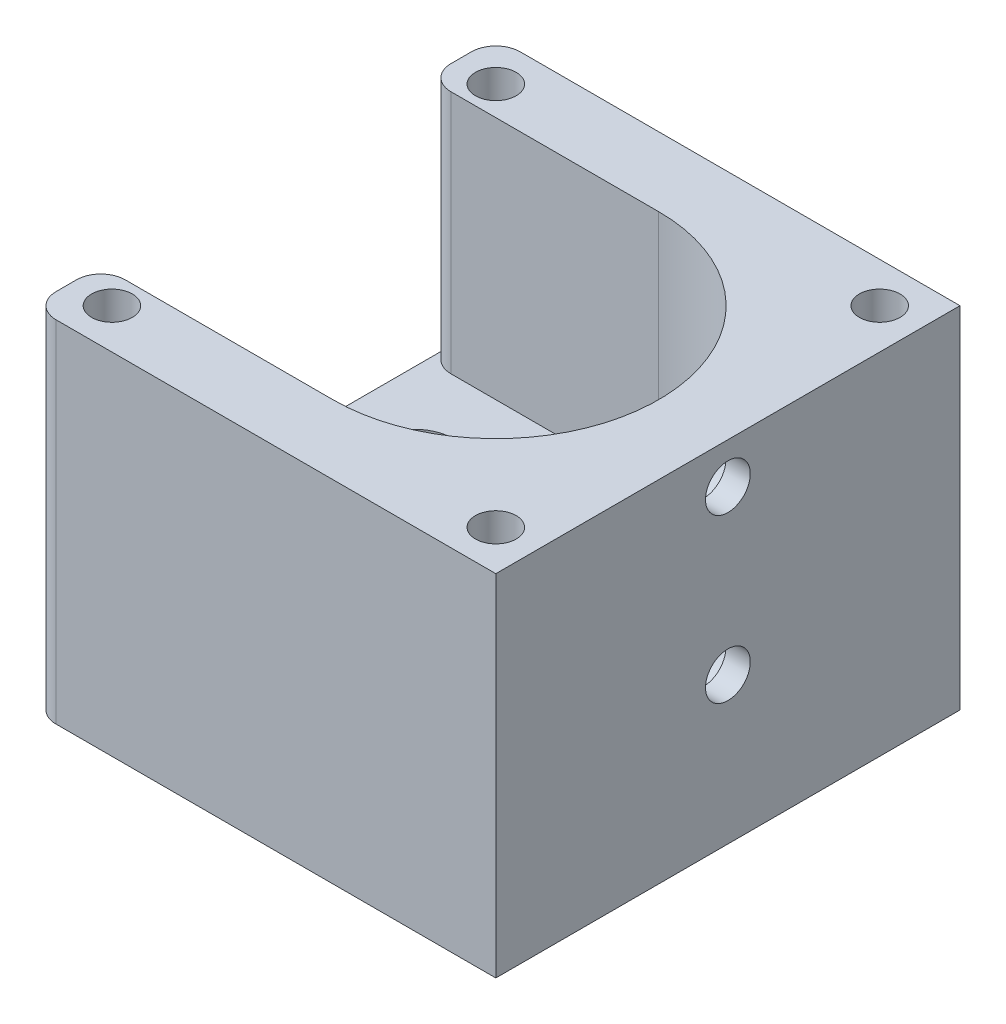
ISO-10303-21;
HEADER;
FILE_DESCRIPTION(('STEP AP214'),'2;1');
FILE_NAME('part.step','',(''),(''),'','','');
FILE_SCHEMA(('AUTOMOTIVE_DESIGN { 1 0 10303 214 1 1 1 1 }'));
ENDSEC;
DATA;
#1=APPLICATION_CONTEXT('core data for automotive mechanical design processes');
#2=APPLICATION_PROTOCOL_DEFINITION('international standard','automotive_design',2000,#1);
#3=PRODUCT_CONTEXT('',#1,'mechanical');
#4=PRODUCT('Part','Part','',(#3));
#5=PRODUCT_RELATED_PRODUCT_CATEGORY('part','',(#4));
#6=PRODUCT_DEFINITION_FORMATION('','',#4);
#7=PRODUCT_DEFINITION_CONTEXT('part definition',#1,'design');
#8=PRODUCT_DEFINITION('design','',#6,#7);
#9=PRODUCT_DEFINITION_SHAPE('','',#8);
#10=(LENGTH_UNIT() NAMED_UNIT(*) SI_UNIT(.MILLI.,.METRE.));
#11=(NAMED_UNIT(*) PLANE_ANGLE_UNIT() SI_UNIT($,.RADIAN.));
#12=(NAMED_UNIT(*) SI_UNIT($,.STERADIAN.) SOLID_ANGLE_UNIT());
#13=UNCERTAINTY_MEASURE_WITH_UNIT(LENGTH_MEASURE(1.E-05),#10,'distance_accuracy_value','');
#14=(GEOMETRIC_REPRESENTATION_CONTEXT(3) GLOBAL_UNCERTAINTY_ASSIGNED_CONTEXT((#13)) GLOBAL_UNIT_ASSIGNED_CONTEXT((#10,
#11,#12)) REPRESENTATION_CONTEXT('',''));
#15=CARTESIAN_POINT('',(0.,0.,0.));
#16=DIRECTION('',(0.,0.,1.));
#17=DIRECTION('',(1.,0.,0.));
#18=AXIS2_PLACEMENT_3D('',#15,#16,#17);
#19=CARTESIAN_POINT('',(8.49999999999999,0.,-8.5));
#20=DIRECTION('',(0.,1.,0.));
#21=DIRECTION('',(0.,0.,1.));
#22=AXIS2_PLACEMENT_3D('',#19,#20,#21);
#23=CYLINDRICAL_SURFACE('',#22,2.75);
#24=CARTESIAN_POINT('',(8.49999999999999,0.,-8.5));
#25=DIRECTION('',(0.,1.,0.));
#26=DIRECTION('',(0.,0.,1.));
#27=AXIS2_PLACEMENT_3D('',#24,#25,#26);
#28=CIRCLE('',#27,2.75);
#29=CARTESIAN_POINT('',(8.49999999999999,0.,-5.75));
#30=VERTEX_POINT('',#29);
#31=EDGE_CURVE('E404',#30,#30,#28,.T.);
#32=ORIENTED_EDGE('',*,*,#31,.F.);
#33=EDGE_LOOP('',(#32));
#34=FACE_BOUND('',#33,.T.);
#35=CARTESIAN_POINT('',(8.49999999999999,8.,-8.5));
#36=DIRECTION('',(0.,1.,0.));
#37=DIRECTION('',(0.,0.,1.));
#38=AXIS2_PLACEMENT_3D('',#35,#36,#37);
#39=CIRCLE('',#38,2.75);
#40=CARTESIAN_POINT('',(8.49999999999999,8.,-5.75));
#41=VERTEX_POINT('',#40);
#42=EDGE_CURVE('E401',#41,#41,#39,.F.);
#43=ORIENTED_EDGE('',*,*,#42,.F.);
#44=EDGE_LOOP('',(#43));
#45=FACE_BOUND('',#44,.T.);
#46=ADVANCED_FACE('F39',(#34,#45),#23,.F.);
#47=CARTESIAN_POINT('',(-18.5,0.,-8.5));
#48=DIRECTION('',(0.,1.,0.));
#49=DIRECTION('',(0.,0.,1.));
#50=AXIS2_PLACEMENT_3D('',#47,#48,#49);
#51=CYLINDRICAL_SURFACE('',#50,2.75);
#52=CARTESIAN_POINT('',(-18.5,0.,-8.5));
#53=DIRECTION('',(0.,1.,0.));
#54=DIRECTION('',(0.,0.,1.));
#55=AXIS2_PLACEMENT_3D('',#52,#53,#54);
#56=CIRCLE('',#55,2.75);
#57=CARTESIAN_POINT('',(-18.5,0.,-5.75));
#58=VERTEX_POINT('',#57);
#59=EDGE_CURVE('E429',#58,#58,#56,.T.);
#60=ORIENTED_EDGE('',*,*,#59,.F.);
#61=EDGE_LOOP('',(#60));
#62=FACE_BOUND('',#61,.T.);
#63=CARTESIAN_POINT('',(-18.5,8.,-8.5));
#64=DIRECTION('',(0.,1.,0.));
#65=DIRECTION('',(0.,0.,1.));
#66=AXIS2_PLACEMENT_3D('',#63,#64,#65);
#67=CIRCLE('',#66,2.75);
#68=CARTESIAN_POINT('',(-18.5,8.,-5.75));
#69=VERTEX_POINT('',#68);
#70=EDGE_CURVE('E405',#69,#69,#67,.F.);
#71=ORIENTED_EDGE('',*,*,#70,.F.);
#72=EDGE_LOOP('',(#71));
#73=FACE_BOUND('',#72,.T.);
#74=ADVANCED_FACE('F258',(#62,#73),#51,.F.);
#75=CARTESIAN_POINT('',(36.278174593052,38.,0.));
#76=DIRECTION('',(-1.,0.,0.));
#77=DIRECTION('',(0.,0.,1.));
#78=AXIS2_PLACEMENT_3D('',#75,#76,#77);
#79=CYLINDRICAL_SURFACE('',#78,2.75);
#80=CARTESIAN_POINT('',(28.5,38.,0.));
#81=DIRECTION('',(-1.,0.,0.));
#82=DIRECTION('',(0.,0.,1.));
#83=AXIS2_PLACEMENT_3D('',#80,#81,#82);
#84=CIRCLE('',#83,2.75);
#85=CARTESIAN_POINT('',(28.5,38.,2.75));
#86=VERTEX_POINT('',#85);
#87=EDGE_CURVE('E331',#86,#86,#84,.F.);
#88=ORIENTED_EDGE('',*,*,#87,.T.);
#89=EDGE_LOOP('',(#88));
#90=FACE_BOUND('',#89,.T.);
#91=CARTESIAN_POINT('',(25.5,38.,0.));
#92=DIRECTION('',(-1.,0.,0.));
#93=DIRECTION('',(0.,0.,1.));
#94=AXIS2_PLACEMENT_3D('',#91,#92,#93);
#95=CIRCLE('',#94,2.75);
#96=CARTESIAN_POINT('',(25.5,38.,2.75));
#97=VERTEX_POINT('',#96);
#98=EDGE_CURVE('E220',#97,#97,#95,.F.);
#99=ORIENTED_EDGE('',*,*,#98,.F.);
#100=EDGE_LOOP('',(#99));
#101=FACE_BOUND('',#100,.T.);
#102=ADVANCED_FACE('F254',(#90,#101),#79,.F.);
#103=CARTESIAN_POINT('',(36.278174593052,18.,0.));
#104=DIRECTION('',(-1.,0.,0.));
#105=DIRECTION('',(0.,0.,1.));
#106=AXIS2_PLACEMENT_3D('',#103,#104,#105);
#107=CYLINDRICAL_SURFACE('',#106,2.75);
#108=CARTESIAN_POINT('',(28.5,18.,0.));
#109=DIRECTION('',(-1.,0.,0.));
#110=DIRECTION('',(0.,0.,1.));
#111=AXIS2_PLACEMENT_3D('',#108,#109,#110);
#112=CIRCLE('',#111,2.75);
#113=CARTESIAN_POINT('',(28.5,18.,2.75));
#114=VERTEX_POINT('',#113);
#115=EDGE_CURVE('E182',#114,#114,#112,.F.);
#116=ORIENTED_EDGE('',*,*,#115,.T.);
#117=EDGE_LOOP('',(#116));
#118=FACE_BOUND('',#117,.T.);
#119=CARTESIAN_POINT('',(25.5,18.,0.));
#120=DIRECTION('',(-1.,0.,0.));
#121=DIRECTION('',(0.,0.,1.));
#122=AXIS2_PLACEMENT_3D('',#119,#120,#121);
#123=CIRCLE('',#122,2.75);
#124=CARTESIAN_POINT('',(25.5,18.,2.75));
#125=VERTEX_POINT('',#124);
#126=EDGE_CURVE('E216',#125,#125,#123,.F.);
#127=ORIENTED_EDGE('',*,*,#126,.F.);
#128=EDGE_LOOP('',(#127));
#129=FACE_BOUND('',#128,.T.);
#130=ADVANCED_FACE('F250',(#118,#129),#107,.F.);
#131=CARTESIAN_POINT('',(-28.5,13.,-28.5));
#132=DIRECTION('',(1.,0.,0.));
#133=DIRECTION('',(0.,0.,-1.));
#134=AXIS2_PLACEMENT_3D('',#131,#132,#133);
#135=PLANE('',#134);
#136=DIRECTION('',(0.,0.,1.));
#137=VECTOR('',#136,1.);
#138=CARTESIAN_POINT('',(-28.5,43.,20.));
#139=LINE('',#138,#137);
#140=CARTESIAN_POINT('',(-28.5,43.,23.));
#141=VERTEX_POINT('',#140);
#142=CARTESIAN_POINT('',(-28.5,43.,25.5));
#143=VERTEX_POINT('',#142);
#144=EDGE_CURVE('E165',#141,#143,#139,.T.);
#145=ORIENTED_EDGE('',*,*,#144,.F.);
#146=DIRECTION('',(0.,-1.,0.));
#147=VECTOR('',#146,1.);
#148=CARTESIAN_POINT('',(-28.5,13.,23.));
#149=LINE('',#148,#147);
#150=CARTESIAN_POINT('',(-28.5,13.,23.));
#151=VERTEX_POINT('',#150);
#152=EDGE_CURVE('E388',#141,#151,#149,.T.);
#153=ORIENTED_EDGE('',*,*,#152,.T.);
#154=DIRECTION('',(0.,0.,1.));
#155=VECTOR('',#154,1.);
#156=CARTESIAN_POINT('',(-28.5,13.,-28.5));
#157=LINE('',#156,#155);
#158=CARTESIAN_POINT('',(-28.5,13.,-23.));
#159=VERTEX_POINT('',#158);
#160=EDGE_CURVE('E192',#159,#151,#157,.T.);
#161=ORIENTED_EDGE('',*,*,#160,.F.);
#162=DIRECTION('',(0.,-1.,0.));
#163=VECTOR('',#162,1.);
#164=CARTESIAN_POINT('',(-28.5,13.,-23.));
#165=LINE('',#164,#163);
#166=CARTESIAN_POINT('',(-28.5,43.,-23.));
#167=VERTEX_POINT('',#166);
#168=EDGE_CURVE('E353',#159,#167,#165,.F.);
#169=ORIENTED_EDGE('',*,*,#168,.T.);
#170=DIRECTION('',(0.,0.,1.));
#171=VECTOR('',#170,1.);
#172=CARTESIAN_POINT('',(-28.5,43.,-28.5));
#173=LINE('',#172,#171);
#174=CARTESIAN_POINT('',(-28.5,43.,-25.5));
#175=VERTEX_POINT('',#174);
#176=EDGE_CURVE('E144',#175,#167,#173,.T.);
#177=ORIENTED_EDGE('',*,*,#176,.F.);
#178=DIRECTION('',(0.,-1.,0.));
#179=VECTOR('',#178,1.);
#180=CARTESIAN_POINT('',(-28.5,13.,-25.5));
#181=LINE('',#180,#179);
#182=CARTESIAN_POINT('',(-28.5,0.,-25.5));
#183=VERTEX_POINT('',#182);
#184=EDGE_CURVE('E215',#175,#183,#181,.T.);
#185=ORIENTED_EDGE('',*,*,#184,.T.);
#186=DIRECTION('',(0.,0.,1.));
#187=VECTOR('',#186,1.);
#188=CARTESIAN_POINT('',(-28.5,0.,-28.5));
#189=LINE('',#188,#187);
#190=CARTESIAN_POINT('',(-28.5,0.,25.5));
#191=VERTEX_POINT('',#190);
#192=EDGE_CURVE('E155',#183,#191,#189,.T.);
#193=ORIENTED_EDGE('',*,*,#192,.T.);
#194=DIRECTION('',(0.,-1.,0.));
#195=VECTOR('',#194,1.);
#196=CARTESIAN_POINT('',(-28.5,13.,25.5));
#197=LINE('',#196,#195);
#198=EDGE_CURVE('E396',#191,#143,#197,.F.);
#199=ORIENTED_EDGE('',*,*,#198,.T.);
#200=EDGE_LOOP('',(#145,#153,#161,#169,#177,#185,#193,#199));
#201=FACE_BOUND('',#200,.T.);
#202=ADVANCED_FACE('F253',(#201),#135,.F.);
#203=CARTESIAN_POINT('',(-28.5,13.,28.5));
#204=DIRECTION('',(0.,0.,-1.));
#205=DIRECTION('',(-1.,0.,0.));
#206=AXIS2_PLACEMENT_3D('',#203,#204,#205);
#207=PLANE('',#206);
#208=DIRECTION('',(1.,0.,0.));
#209=VECTOR('',#208,1.);
#210=CARTESIAN_POINT('',(-28.5,43.,28.5));
#211=LINE('',#210,#209);
#212=CARTESIAN_POINT('',(-25.5,43.,28.5));
#213=VERTEX_POINT('',#212);
#214=CARTESIAN_POINT('',(28.5,43.,28.5));
#215=VERTEX_POINT('',#214);
#216=EDGE_CURVE('E172',#213,#215,#211,.T.);
#217=ORIENTED_EDGE('',*,*,#216,.F.);
#218=DIRECTION('',(0.,-1.,0.));
#219=VECTOR('',#218,1.);
#220=CARTESIAN_POINT('',(-25.5,13.,28.5));
#221=LINE('',#220,#219);
#222=CARTESIAN_POINT('',(-25.5,0.,28.5));
#223=VERTEX_POINT('',#222);
#224=EDGE_CURVE('E367',#213,#223,#221,.T.);
#225=ORIENTED_EDGE('',*,*,#224,.T.);
#226=DIRECTION('',(1.,0.,0.));
#227=VECTOR('',#226,1.);
#228=CARTESIAN_POINT('',(-28.5,0.,28.5));
#229=LINE('',#228,#227);
#230=CARTESIAN_POINT('',(28.5,0.,28.5));
#231=VERTEX_POINT('',#230);
#232=EDGE_CURVE('E200',#223,#231,#229,.T.);
#233=ORIENTED_EDGE('',*,*,#232,.T.);
#234=DIRECTION('',(0.,-1.,0.));
#235=VECTOR('',#234,1.);
#236=CARTESIAN_POINT('',(28.5,13.,28.5));
#237=LINE('',#236,#235);
#238=EDGE_CURVE('E211',#215,#231,#237,.T.);
#239=ORIENTED_EDGE('',*,*,#238,.F.);
#240=EDGE_LOOP('',(#217,#225,#233,#239));
#241=FACE_BOUND('',#240,.T.);
#242=ADVANCED_FACE('F507',(#241),#207,.F.);
#243=CARTESIAN_POINT('',(28.5,13.,-28.5));
#244=DIRECTION('',(-1.,0.,0.));
#245=DIRECTION('',(0.,0.,1.));
#246=AXIS2_PLACEMENT_3D('',#243,#244,#245);
#247=PLANE('',#246);
#248=ORIENTED_EDGE('',*,*,#115,.F.);
#249=EDGE_LOOP('',(#248));
#250=FACE_BOUND('',#249,.T.);
#251=ORIENTED_EDGE('',*,*,#87,.F.);
#252=EDGE_LOOP('',(#251));
#253=FACE_BOUND('',#252,.T.);
#254=DIRECTION('',(0.,0.,-1.));
#255=VECTOR('',#254,1.);
#256=CARTESIAN_POINT('',(28.5,0.,-28.5));
#257=LINE('',#256,#255);
#258=CARTESIAN_POINT('',(28.5,0.,-28.5));
#259=VERTEX_POINT('',#258);
#260=EDGE_CURVE('E203',#231,#259,#257,.T.);
#261=ORIENTED_EDGE('',*,*,#260,.T.);
#262=DIRECTION('',(0.,-1.,0.));
#263=VECTOR('',#262,1.);
#264=CARTESIAN_POINT('',(28.5,13.,-28.5));
#265=LINE('',#264,#263);
#266=CARTESIAN_POINT('',(28.5,43.,-28.5));
#267=VERTEX_POINT('',#266);
#268=EDGE_CURVE('E195',#267,#259,#265,.T.);
#269=ORIENTED_EDGE('',*,*,#268,.F.);
#270=DIRECTION('',(0.,0.,-1.));
#271=VECTOR('',#270,1.);
#272=CARTESIAN_POINT('',(28.5,43.,28.5));
#273=LINE('',#272,#271);
#274=EDGE_CURVE('E175',#215,#267,#273,.T.);
#275=ORIENTED_EDGE('',*,*,#274,.F.);
#276=ORIENTED_EDGE('',*,*,#238,.T.);
#277=EDGE_LOOP('',(#261,#269,#275,#276));
#278=FACE_BOUND('',#277,.T.);
#279=ADVANCED_FACE('F510',(#250,#253,#278),#247,.F.);
#280=CARTESIAN_POINT('',(-28.5,13.,-28.5));
#281=DIRECTION('',(0.,0.,1.));
#282=DIRECTION('',(1.,0.,0.));
#283=AXIS2_PLACEMENT_3D('',#280,#281,#282);
#284=PLANE('',#283);
#285=DIRECTION('',(-1.,0.,0.));
#286=VECTOR('',#285,1.);
#287=CARTESIAN_POINT('',(-28.5,0.,-28.5));
#288=LINE('',#287,#286);
#289=CARTESIAN_POINT('',(-25.5,0.,-28.5));
#290=VERTEX_POINT('',#289);
#291=EDGE_CURVE('E196',#259,#290,#288,.T.);
#292=ORIENTED_EDGE('',*,*,#291,.T.);
#293=DIRECTION('',(0.,-1.,0.));
#294=VECTOR('',#293,1.);
#295=CARTESIAN_POINT('',(-25.5,13.,-28.5));
#296=LINE('',#295,#294);
#297=CARTESIAN_POINT('',(-25.5,43.,-28.5));
#298=VERTEX_POINT('',#297);
#299=EDGE_CURVE('E374',#290,#298,#296,.F.);
#300=ORIENTED_EDGE('',*,*,#299,.T.);
#301=DIRECTION('',(-1.,0.,0.));
#302=VECTOR('',#301,1.);
#303=CARTESIAN_POINT('',(28.5,43.,-28.5));
#304=LINE('',#303,#302);
#305=EDGE_CURVE('E189',#267,#298,#304,.T.);
#306=ORIENTED_EDGE('',*,*,#305,.F.);
#307=ORIENTED_EDGE('',*,*,#268,.T.);
#308=EDGE_LOOP('',(#292,#300,#306,#307));
#309=FACE_BOUND('',#308,.T.);
#310=ADVANCED_FACE('F513',(#309),#284,.F.);
#311=CARTESIAN_POINT('',(0.,13.,0.));
#312=DIRECTION('',(0.,1.,0.));
#313=DIRECTION('',(0.,0.,1.));
#314=AXIS2_PLACEMENT_3D('',#311,#312,#313);
#315=PLANE('',#314);
#316=CARTESIAN_POINT('',(-18.5,13.,-8.5));
#317=DIRECTION('',(0.,1.,0.));
#318=DIRECTION('',(0.,0.,1.));
#319=AXIS2_PLACEMENT_3D('',#316,#317,#318);
#320=CIRCLE('',#319,4.75);
#321=CARTESIAN_POINT('',(-18.5,13.,-3.75));
#322=VERTEX_POINT('',#321);
#323=EDGE_CURVE('E413',#322,#322,#320,.T.);
#324=ORIENTED_EDGE('',*,*,#323,.F.);
#325=EDGE_LOOP('',(#324));
#326=FACE_BOUND('',#325,.T.);
#327=CARTESIAN_POINT('',(8.49999999999999,13.,-8.5));
#328=DIRECTION('',(0.,1.,0.));
#329=DIRECTION('',(0.,0.,1.));
#330=AXIS2_PLACEMENT_3D('',#327,#328,#329);
#331=CIRCLE('',#330,4.75);
#332=CARTESIAN_POINT('',(8.49999999999999,13.,-3.75));
#333=VERTEX_POINT('',#332);
#334=EDGE_CURVE('E425',#333,#333,#331,.T.);
#335=ORIENTED_EDGE('',*,*,#334,.F.);
#336=EDGE_LOOP('',(#335));
#337=FACE_BOUND('',#336,.T.);
#338=DIRECTION('',(-1.,0.,0.));
#339=VECTOR('',#338,1.);
#340=CARTESIAN_POINT('',(0.,13.,20.));
#341=LINE('',#340,#339);
#342=CARTESIAN_POINT('',(0.,13.,20.));
#343=VERTEX_POINT('',#342);
#344=CARTESIAN_POINT('',(-25.5,13.,20.));
#345=VERTEX_POINT('',#344);
#346=EDGE_CURVE('E185',#343,#345,#341,.T.);
#347=ORIENTED_EDGE('',*,*,#346,.F.);
#348=CARTESIAN_POINT('',(0.,13.,0.));
#349=DIRECTION('',(0.,-1.,0.));
#350=DIRECTION('',(0.,0.,1.));
#351=AXIS2_PLACEMENT_3D('',#348,#349,#350);
#352=CIRCLE('',#351,20.);
#353=CARTESIAN_POINT('',(0.,13.,-20.));
#354=VERTEX_POINT('',#353);
#355=EDGE_CURVE('E181',#354,#343,#352,.T.);
#356=ORIENTED_EDGE('',*,*,#355,.F.);
#357=DIRECTION('',(1.,0.,0.));
#358=VECTOR('',#357,1.);
#359=CARTESIAN_POINT('',(0.,13.,-20.));
#360=LINE('',#359,#358);
#361=CARTESIAN_POINT('',(-25.5,13.,-20.));
#362=VERTEX_POINT('',#361);
#363=EDGE_CURVE('E150',#362,#354,#360,.T.);
#364=ORIENTED_EDGE('',*,*,#363,.F.);
#365=CARTESIAN_POINT('',(-25.5,13.,-23.));
#366=DIRECTION('',(0.,1.,0.));
#367=DIRECTION('',(0.,0.,1.));
#368=AXIS2_PLACEMENT_3D('',#365,#366,#367);
#369=CIRCLE('',#368,3.);
#370=EDGE_CURVE('E11',#362,#159,#369,.F.);
#371=ORIENTED_EDGE('',*,*,#370,.T.);
#372=ORIENTED_EDGE('',*,*,#160,.T.);
#373=CARTESIAN_POINT('',(-25.5,13.,23.));
#374=DIRECTION('',(0.,1.,0.));
#375=DIRECTION('',(0.,0.,1.));
#376=AXIS2_PLACEMENT_3D('',#373,#374,#375);
#377=CIRCLE('',#376,3.);
#378=EDGE_CURVE('E48',#151,#345,#377,.F.);
#379=ORIENTED_EDGE('',*,*,#378,.T.);
#380=EDGE_LOOP('',(#347,#356,#364,#371,#372,#379));
#381=FACE_BOUND('',#380,.T.);
#382=ADVANCED_FACE('F379',(#326,#337,#381),#315,.T.);
#383=CARTESIAN_POINT('',(0.,0.,0.));
#384=DIRECTION('',(0.,1.,0.));
#385=DIRECTION('',(0.,0.,1.));
#386=AXIS2_PLACEMENT_3D('',#383,#384,#385);
#387=PLANE('',#386);
#388=ORIENTED_EDGE('',*,*,#59,.T.);
#389=EDGE_LOOP('',(#388));
#390=FACE_BOUND('',#389,.T.);
#391=ORIENTED_EDGE('',*,*,#31,.T.);
#392=EDGE_LOOP('',(#391));
#393=FACE_BOUND('',#392,.T.);
#394=ORIENTED_EDGE('',*,*,#232,.F.);
#395=CARTESIAN_POINT('',(-25.5,0.,25.5));
#396=DIRECTION('',(0.,1.,0.));
#397=DIRECTION('',(0.,0.,1.));
#398=AXIS2_PLACEMENT_3D('',#395,#396,#397);
#399=CIRCLE('',#398,3.);
#400=EDGE_CURVE('E63',#223,#191,#399,.F.);
#401=ORIENTED_EDGE('',*,*,#400,.T.);
#402=ORIENTED_EDGE('',*,*,#192,.F.);
#403=CARTESIAN_POINT('',(-25.5,0.,-25.5));
#404=DIRECTION('',(0.,1.,0.));
#405=DIRECTION('',(0.,0.,1.));
#406=AXIS2_PLACEMENT_3D('',#403,#404,#405);
#407=CIRCLE('',#406,3.);
#408=EDGE_CURVE('E55',#183,#290,#407,.F.);
#409=ORIENTED_EDGE('',*,*,#408,.T.);
#410=ORIENTED_EDGE('',*,*,#291,.F.);
#411=ORIENTED_EDGE('',*,*,#260,.F.);
#412=EDGE_LOOP('',(#394,#401,#402,#409,#410,#411));
#413=FACE_BOUND('',#412,.T.);
#414=ADVANCED_FACE('F498',(#390,#393,#413),#387,.F.);
#415=CARTESIAN_POINT('',(0.,43.,-20.));
#416=DIRECTION('',(0.,0.,-1.));
#417=DIRECTION('',(-1.,0.,0.));
#418=AXIS2_PLACEMENT_3D('',#415,#416,#417);
#419=PLANE('',#418);
#420=DIRECTION('',(1.,0.,0.));
#421=VECTOR('',#420,1.);
#422=CARTESIAN_POINT('',(0.,43.,-20.));
#423=LINE('',#422,#421);
#424=CARTESIAN_POINT('',(-25.5,43.,-20.));
#425=VERTEX_POINT('',#424);
#426=CARTESIAN_POINT('',(0.,43.,-20.));
#427=VERTEX_POINT('',#426);
#428=EDGE_CURVE('E130',#425,#427,#423,.T.);
#429=ORIENTED_EDGE('',*,*,#428,.F.);
#430=DIRECTION('',(0.,-1.,0.));
#431=VECTOR('',#430,1.);
#432=CARTESIAN_POINT('',(-25.5,43.,-20.));
#433=LINE('',#432,#431);
#434=EDGE_CURVE('E354',#425,#362,#433,.T.);
#435=ORIENTED_EDGE('',*,*,#434,.T.);
#436=ORIENTED_EDGE('',*,*,#363,.T.);
#437=DIRECTION('',(0.,-1.,0.));
#438=VECTOR('',#437,1.);
#439=CARTESIAN_POINT('',(0.,43.,-20.));
#440=LINE('',#439,#438);
#441=EDGE_CURVE('E147',#427,#354,#440,.T.);
#442=ORIENTED_EDGE('',*,*,#441,.F.);
#443=EDGE_LOOP('',(#429,#435,#436,#442));
#444=FACE_BOUND('',#443,.T.);
#445=ADVANCED_FACE('F148',(#444),#419,.F.);
#446=CARTESIAN_POINT('',(0.,43.,0.));
#447=DIRECTION('',(0.,-1.,0.));
#448=DIRECTION('',(0.,0.,-1.));
#449=AXIS2_PLACEMENT_3D('',#446,#447,#448);
#450=CYLINDRICAL_SURFACE('',#449,20.);
#451=CARTESIAN_POINT('',(19.4277507704829,38.,4.75));
#452=CARTESIAN_POINT('',(19.4277559819265,37.7372598037119,4.74999183192296));
#453=CARTESIAN_POINT('',(19.4331388499466,37.474426136053,4.72812607169995));
#454=CARTESIAN_POINT('',(19.4540402105482,36.9562761002786,4.64136188794561));
#455=CARTESIAN_POINT('',(19.4695651899653,36.700964652629,4.57643592295243));
#456=CARTESIAN_POINT('',(19.5088955531062,36.2054287364653,4.4057463421885));
#457=CARTESIAN_POINT('',(19.5326909133285,35.9651864187214,4.30003214376829));
#458=CARTESIAN_POINT('',(19.5858686119401,35.5058292221803,4.05091395089128));
#459=CARTESIAN_POINT('',(19.6152510436008,35.2867146961856,3.90750932720967));
#460=CARTESIAN_POINT('',(19.6769456194717,34.8714761456058,3.58403840084774));
#461=CARTESIAN_POINT('',(19.7093007870799,34.6758337912815,3.40336187007806));
#462=CARTESIAN_POINT('',(19.7729206114238,34.3173262252618,3.01179155346311));
#463=CARTESIAN_POINT('',(19.8041851734187,34.1544638553276,2.80089515050866));
#464=CARTESIAN_POINT('',(19.8625741081372,33.8641956177069,2.35160074903825));
#465=CARTESIAN_POINT('',(19.8896417865058,33.7372588605197,2.11289167619397));
#466=CARTESIAN_POINT('',(19.9360983324634,33.5254889404029,1.61677640777372));
#467=CARTESIAN_POINT('',(19.955488219503,33.4406501873571,1.35937269983026));
#468=CARTESIAN_POINT('',(19.984100369592,33.3170158515188,0.838191316341486));
#469=CARTESIAN_POINT('',(19.9935028010491,33.2774033919827,0.57461748008035));
#470=CARTESIAN_POINT('',(20.0017069896615,33.2427861564771,0.044409020240374));
#471=CARTESIAN_POINT('',(20.0005101671058,33.2477754039266,-0.22222518846987));
#472=CARTESIAN_POINT('',(19.9877863010115,33.3016237666331,-0.745334372823519));
#473=CARTESIAN_POINT('',(19.9764667660444,33.3496016823241,-1.00190585824914));
#474=CARTESIAN_POINT('',(19.9450087545622,33.486654119388,-1.50324728469097));
#475=CARTESIAN_POINT('',(19.9248698357466,33.5757307019098,-1.74801663313535));
#476=CARTESIAN_POINT('',(19.8777116469288,33.793192154222,-2.2211787742469));
#477=CARTESIAN_POINT('',(19.8506363309143,33.9218990330356,-2.44941775919545));
#478=CARTESIAN_POINT('',(19.7925557676866,34.21472511825,-2.88137207620285));
#479=CARTESIAN_POINT('',(19.7615498975453,34.3788499407137,-3.08508351104907));
#480=CARTESIAN_POINT('',(19.6981044798807,34.7426081437258,-3.46745045058158));
#481=CARTESIAN_POINT('',(19.6656484162678,34.9430122333591,-3.64537074407425));
#482=CARTESIAN_POINT('',(19.6036618123393,35.3711522256291,-3.96523200476322));
#483=CARTESIAN_POINT('',(19.5741313828765,35.5988891631892,-4.10717160896274));
#484=CARTESIAN_POINT('',(19.5212863176313,36.0765663139191,-4.3514521373662));
#485=CARTESIAN_POINT('',(19.4979970811874,36.3265918975182,-4.45363199380446));
#486=CARTESIAN_POINT('',(19.4606064789487,36.8409548555512,-4.6142899630517));
#487=CARTESIAN_POINT('',(19.4465033620939,37.1052894919795,-4.6727764050207));
#488=CARTESIAN_POINT('',(19.4294451715587,37.6339902547521,-4.74320075037925));
#489=CARTESIAN_POINT('',(19.4262314557574,37.8982043236204,-4.75621884077739));
#490=CARTESIAN_POINT('',(19.4306145221283,38.4250283336886,-4.73828065372101));
#491=CARTESIAN_POINT('',(19.4382104158353,38.687638404943,-4.70732799031779));
#492=CARTESIAN_POINT('',(19.4631104551983,39.1998935994888,-4.60327009705961));
#493=CARTESIAN_POINT('',(19.4802729336774,39.4496711225534,-4.53077955411227));
#494=CARTESIAN_POINT('',(19.5222406435723,39.9335322817217,-4.34637847813474));
#495=CARTESIAN_POINT('',(19.5470467105976,40.1676141985479,-4.23446363498439));
#496=CARTESIAN_POINT('',(19.6020609329742,40.6180568612952,-3.97208094677737));
#497=CARTESIAN_POINT('',(19.6323578004174,40.8340256110131,-3.82095914613844));
#498=CARTESIAN_POINT('',(19.6947156781241,41.2379352249214,-3.4852910283692));
#499=CARTESIAN_POINT('',(19.7267769483006,41.4258719445197,-3.30073977754215));
#500=CARTESIAN_POINT('',(19.7899177986732,41.7726821309629,-2.89852250799558));
#501=CARTESIAN_POINT('',(19.8209594619894,41.9308127639878,-2.68020896566572));
#502=CARTESIAN_POINT('',(19.8778176716627,42.2081617343035,-2.21949450675254));
#503=CARTESIAN_POINT('',(19.9036344815225,42.3273820341268,-1.97709480581489));
#504=CARTESIAN_POINT('',(19.9469767933049,42.5225455796524,-1.47671251134755));
#505=CARTESIAN_POINT('',(19.9645593226519,42.598787251978,-1.21885148210001));
#506=CARTESIAN_POINT('',(19.9897004732305,42.7067420620659,-0.693509413535963));
#507=CARTESIAN_POINT('',(19.9972608288717,42.7384629045352,-0.426030046973755));
#508=CARTESIAN_POINT('',(20.0014429591352,42.7560779216343,0.10394803210251));
#509=CARTESIAN_POINT('',(19.9983276261779,42.7430734434836,0.366408649577264));
#510=CARTESIAN_POINT('',(19.9820832077258,42.6741050323582,0.885290017957531));
#511=CARTESIAN_POINT('',(19.968954368602,42.6181421563263,1.14171091730347));
#512=CARTESIAN_POINT('',(19.9341901702435,42.465411365764,1.64020507715498));
#513=CARTESIAN_POINT('',(19.9125926849913,42.3688249922574,1.88233677084454));
#514=CARTESIAN_POINT('',(19.8631781021279,42.1377572640152,2.3470908880729));
#515=CARTESIAN_POINT('',(19.8353602908625,42.0032715606516,2.56971106898526));
#516=CARTESIAN_POINT('',(19.7757567352568,41.6967674187902,2.99440898808425));
#517=CARTESIAN_POINT('',(19.7438973150332,41.5239901344637,3.19592875444405));
#518=CARTESIAN_POINT('',(19.6801584815131,41.1473047483318,3.5674893601326));
#519=CARTESIAN_POINT('',(19.6482790652191,40.9433889471716,3.7375223909345));
#520=CARTESIAN_POINT('',(19.5875197425717,40.5061907026866,4.04400063056234));
#521=CARTESIAN_POINT('',(19.5586975829844,40.2724816008695,4.17984945567669));
#522=CARTESIAN_POINT('',(19.5080701545674,39.7848995471072,4.4101248381262));
#523=CARTESIAN_POINT('',(19.4862594314562,39.5310424611554,4.50458361415316));
#524=CARTESIAN_POINT('',(19.455795854468,39.0644337589989,4.63415781028952));
#525=CARTESIAN_POINT('',(19.4453540980731,38.8540475986991,4.67750881773091));
#526=CARTESIAN_POINT('',(19.4313296623041,38.4291282206522,4.73543226449892));
#527=CARTESIAN_POINT('',(19.4277465139921,38.214595287442,4.75000667134631));
#528=CARTESIAN_POINT('',(19.4277507704829,38.,4.75));
#529=B_SPLINE_CURVE_WITH_KNOTS('',3,(#451,#452,#453,#454,#455,#456,#457,#458,#459,#460,#461,
#462,#463,#464,#465,#466,#467,#468,#469,#470,#471,#472,#473,#474,#475,#476,#477,#478,#479,#480,
#481,#482,#483,#484,#485,#486,#487,#488,#489,#490,#491,#492,#493,#494,#495,#496,#497,#498,#499,
#500,#501,#502,#503,#504,#505,#506,#507,#508,#509,#510,#511,#512,#513,#514,#515,#516,#517,#518,
#519,#520,#521,#522,#523,#524,#525,#526,#527,#528),.UNSPECIFIED.,.T.,.F.,(4,2,2,2,2,2,2,2,2,2,2,
2,2,2,2,2,2,2,2,2,2,2,2,2,2,2,2,2,2,2,2,2,2,2,2,2,2,2,4),(0.,0.787433214399116,1.57537056025236,
2.36235625607637,3.14935509110976,3.95043951564345,4.7515933578737,5.56277088467069,
6.37384066785989,7.17001689723764,7.96608644145081,8.74620196214962,9.52635661085807,
10.3130254573667,11.0998191341664,11.9058682145071,12.7119478245066,13.5212597079955,
14.3304172751067,15.1202159103393,15.9099496340706,16.688287862353,17.4667112100401,
18.2590619248984,19.0515296745248,19.8616962058661,20.6718218682716,21.4762507716885,
22.2805404446923,23.0651679965395,23.8497762441354,24.6309148241014,25.4121430696396,
26.2105142819856,27.0090832213603,27.8207448446472,28.6317735299573,29.2749602751437,
29.9181030426861),.UNSPECIFIED.);
#530=CARTESIAN_POINT('',(19.4277507704829,38.,4.75));
#531=VERTEX_POINT('',#530);
#532=EDGE_CURVE('E234',#531,#531,#529,.T.);
#533=ORIENTED_EDGE('',*,*,#532,.T.);
#534=EDGE_LOOP('',(#533));
#535=FACE_BOUND('',#534,.T.);
#536=CARTESIAN_POINT('',(19.4277507704829,18.,4.75));
#537=CARTESIAN_POINT('',(19.4277559819265,17.7372598037119,4.74999183192296));
#538=CARTESIAN_POINT('',(19.4331388499466,17.474426136053,4.72812607169995));
#539=CARTESIAN_POINT('',(19.4540402105482,16.9562761002786,4.64136188794561));
#540=CARTESIAN_POINT('',(19.4695651899653,16.700964652629,4.57643592295243));
#541=CARTESIAN_POINT('',(19.5088955531062,16.2054287364653,4.4057463421885));
#542=CARTESIAN_POINT('',(19.5326909133285,15.9651864187214,4.30003214376829));
#543=CARTESIAN_POINT('',(19.5858686119401,15.5058292221803,4.05091395089128));
#544=CARTESIAN_POINT('',(19.6152510436008,15.2867146961856,3.90750932720967));
#545=CARTESIAN_POINT('',(19.6769456194717,14.8714761456058,3.58403840084774));
#546=CARTESIAN_POINT('',(19.7093007870799,14.6758337912815,3.40336187007806));
#547=CARTESIAN_POINT('',(19.7729206114238,14.3173262252618,3.01179155346311));
#548=CARTESIAN_POINT('',(19.8041851734186,14.1544638553276,2.80089515050865));
#549=CARTESIAN_POINT('',(19.8625741081372,13.8641956177069,2.35160074903824));
#550=CARTESIAN_POINT('',(19.8896417865058,13.7372588605197,2.11289167619397));
#551=CARTESIAN_POINT('',(19.9360983324634,13.5254889404029,1.61677640777372));
#552=CARTESIAN_POINT('',(19.955488219503,13.4406501873571,1.35937269983026));
#553=CARTESIAN_POINT('',(19.984100369592,13.3170158515188,0.838191316341485));
#554=CARTESIAN_POINT('',(19.9935028010491,13.2774033919827,0.574617480080348));
#555=CARTESIAN_POINT('',(20.0017069896615,13.2427861564771,0.0444090202403727));
#556=CARTESIAN_POINT('',(20.0005101671058,13.2477754039266,-0.222225188469871));
#557=CARTESIAN_POINT('',(19.9877863010115,13.3016237666331,-0.745334372823521));
#558=CARTESIAN_POINT('',(19.9764667660444,13.3496016823241,-1.00190585824915));
#559=CARTESIAN_POINT('',(19.9450087545622,13.486654119388,-1.50324728469097));
#560=CARTESIAN_POINT('',(19.9248698357466,13.5757307019098,-1.74801663313535));
#561=CARTESIAN_POINT('',(19.8777116469288,13.793192154222,-2.2211787742469));
#562=CARTESIAN_POINT('',(19.8506363309143,13.9218990330356,-2.44941775919545));
#563=CARTESIAN_POINT('',(19.7925557676866,14.21472511825,-2.88137207620285));
#564=CARTESIAN_POINT('',(19.7615498975453,14.3788499407137,-3.08508351104907));
#565=CARTESIAN_POINT('',(19.6981044798807,14.7426081437258,-3.46745045058158));
#566=CARTESIAN_POINT('',(19.6656484162678,14.9430122333591,-3.64537074407426));
#567=CARTESIAN_POINT('',(19.6036618123393,15.3711522256291,-3.96523200476322));
#568=CARTESIAN_POINT('',(19.5741313828765,15.5988891631892,-4.10717160896274));
#569=CARTESIAN_POINT('',(19.5212863176313,16.0765663139192,-4.3514521373662));
#570=CARTESIAN_POINT('',(19.4979970811874,16.3265918975182,-4.45363199380447));
#571=CARTESIAN_POINT('',(19.4606064789487,16.8409548555512,-4.61428996305171));
#572=CARTESIAN_POINT('',(19.4465033620939,17.1052894919795,-4.67277640502071));
#573=CARTESIAN_POINT('',(19.4294451715587,17.6339902547521,-4.74320075037925));
#574=CARTESIAN_POINT('',(19.4262314557574,17.8982043236204,-4.75621884077739));
#575=CARTESIAN_POINT('',(19.4306145221283,18.4250283336886,-4.73828065372101));
#576=CARTESIAN_POINT('',(19.4382104158353,18.687638404943,-4.70732799031779));
#577=CARTESIAN_POINT('',(19.4631104551983,19.1998935994888,-4.60327009705961));
#578=CARTESIAN_POINT('',(19.4802729336774,19.4496711225534,-4.53077955411227));
#579=CARTESIAN_POINT('',(19.5222406435723,19.9335322817217,-4.34637847813474));
#580=CARTESIAN_POINT('',(19.5470467105976,20.1676141985479,-4.23446363498439));
#581=CARTESIAN_POINT('',(19.6020609329742,20.6180568612952,-3.97208094677737));
#582=CARTESIAN_POINT('',(19.6323578004174,20.8340256110131,-3.82095914613844));
#583=CARTESIAN_POINT('',(19.6947156781241,21.2379352249214,-3.4852910283692));
#584=CARTESIAN_POINT('',(19.7267769483006,21.4258719445197,-3.30073977754215));
#585=CARTESIAN_POINT('',(19.7899177986732,21.7726821309629,-2.89852250799558));
#586=CARTESIAN_POINT('',(19.8209594619894,21.9308127639878,-2.68020896566573));
#587=CARTESIAN_POINT('',(19.8778176716627,22.2081617343035,-2.21949450675254));
#588=CARTESIAN_POINT('',(19.9036344815225,22.3273820341268,-1.97709480581489));
#589=CARTESIAN_POINT('',(19.946976793305,22.5225455796524,-1.47671251134755));
#590=CARTESIAN_POINT('',(19.9645593226519,22.598787251978,-1.21885148210001));
#591=CARTESIAN_POINT('',(19.9897004732305,22.7067420620659,-0.693509413535959));
#592=CARTESIAN_POINT('',(19.9972608288717,22.7384629045351,-0.426030046973752));
#593=CARTESIAN_POINT('',(20.0014429591352,22.7560779216343,0.103948032102514));
#594=CARTESIAN_POINT('',(19.9983276261779,22.7430734434836,0.366408649577268));
#595=CARTESIAN_POINT('',(19.9820832077258,22.6741050323582,0.885290017957534));
#596=CARTESIAN_POINT('',(19.968954368602,22.6181421563263,1.14171091730347));
#597=CARTESIAN_POINT('',(19.9341901702435,22.465411365764,1.64020507715498));
#598=CARTESIAN_POINT('',(19.9125926849913,22.3688249922574,1.88233677084454));
#599=CARTESIAN_POINT('',(19.8631781021279,22.1377572640152,2.3470908880729));
#600=CARTESIAN_POINT('',(19.8353602908625,22.0032715606516,2.56971106898526));
#601=CARTESIAN_POINT('',(19.7757567352568,21.6967674187902,2.99440898808425));
#602=CARTESIAN_POINT('',(19.7438973150332,21.5239901344637,3.19592875444405));
#603=CARTESIAN_POINT('',(19.6801584815131,21.1473047483318,3.5674893601326));
#604=CARTESIAN_POINT('',(19.6482790652191,20.9433889471716,3.7375223909345));
#605=CARTESIAN_POINT('',(19.5875197425717,20.5061907026866,4.04400063056234));
#606=CARTESIAN_POINT('',(19.5586975829844,20.2724816008695,4.17984945567669));
#607=CARTESIAN_POINT('',(19.5080701545674,19.7848995471072,4.4101248381262));
#608=CARTESIAN_POINT('',(19.4862594314562,19.5310424611554,4.50458361415316));
#609=CARTESIAN_POINT('',(19.455795854468,19.0644337589989,4.63415781028952));
#610=CARTESIAN_POINT('',(19.4453540980731,18.8540475986991,4.67750881773091));
#611=CARTESIAN_POINT('',(19.4313296623041,18.4291282206522,4.73543226449892));
#612=CARTESIAN_POINT('',(19.4277465139921,18.214595287442,4.75000667134631));
#613=CARTESIAN_POINT('',(19.4277507704829,18.,4.75));
#614=B_SPLINE_CURVE_WITH_KNOTS('',3,(#536,#537,#538,#539,#540,#541,#542,#543,#544,#545,#546,
#547,#548,#549,#550,#551,#552,#553,#554,#555,#556,#557,#558,#559,#560,#561,#562,#563,#564,#565,
#566,#567,#568,#569,#570,#571,#572,#573,#574,#575,#576,#577,#578,#579,#580,#581,#582,#583,#584,
#585,#586,#587,#588,#589,#590,#591,#592,#593,#594,#595,#596,#597,#598,#599,#600,#601,#602,#603,
#604,#605,#606,#607,#608,#609,#610,#611,#612,#613),.UNSPECIFIED.,.T.,.F.,(4,2,2,2,2,2,2,2,2,2,2,
2,2,2,2,2,2,2,2,2,2,2,2,2,2,2,2,2,2,2,2,2,2,2,2,2,2,2,4),(0.,0.787433214399119,1.57537056025236,
2.36235625607637,3.14935509110977,3.95043951564346,4.75159335787371,5.56277088467069,
6.37384066785989,7.17001689723764,7.96608644145081,8.74620196214963,9.52635661085808,
10.3130254573667,11.0998191341664,11.9058682145072,12.7119478245066,13.5212597079955,
14.3304172751067,15.1202159103393,15.9099496340706,16.688287862353,17.4667112100401,
18.2590619248984,19.0515296745248,19.8616962058661,20.6718218682716,21.4762507716885,
22.2805404446923,23.0651679965395,23.8497762441354,24.6309148241014,25.4121430696396,
26.2105142819856,27.0090832213604,27.8207448446472,28.6317735299573,29.2749602751437,
29.9181030426861),.UNSPECIFIED.);
#615=CARTESIAN_POINT('',(19.4277507704829,18.,4.75));
#616=VERTEX_POINT('',#615);
#617=EDGE_CURVE('E225',#616,#616,#614,.T.);
#618=ORIENTED_EDGE('',*,*,#617,.T.);
#619=EDGE_LOOP('',(#618));
#620=FACE_BOUND('',#619,.T.);
#621=ORIENTED_EDGE('',*,*,#355,.T.);
#622=DIRECTION('',(0.,-1.,0.));
#623=VECTOR('',#622,1.);
#624=CARTESIAN_POINT('',(0.,43.,20.));
#625=LINE('',#624,#623);
#626=CARTESIAN_POINT('',(0.,43.,20.));
#627=VERTEX_POINT('',#626);
#628=EDGE_CURVE('E156',#627,#343,#625,.T.);
#629=ORIENTED_EDGE('',*,*,#628,.F.);
#630=CARTESIAN_POINT('',(0.,43.,0.));
#631=DIRECTION('',(0.,-1.,0.));
#632=DIRECTION('',(0.,0.,1.));
#633=AXIS2_PLACEMENT_3D('',#630,#631,#632);
#634=CIRCLE('',#633,20.);
#635=EDGE_CURVE('E135',#427,#627,#634,.T.);
#636=ORIENTED_EDGE('',*,*,#635,.F.);
#637=ORIENTED_EDGE('',*,*,#441,.T.);
#638=EDGE_LOOP('',(#621,#629,#636,#637));
#639=FACE_BOUND('',#638,.T.);
#640=ADVANCED_FACE('F158',(#535,#620,#639),#450,.F.);
#641=CARTESIAN_POINT('',(0.,43.,20.));
#642=DIRECTION('',(0.,0.,1.));
#643=DIRECTION('',(1.,0.,0.));
#644=AXIS2_PLACEMENT_3D('',#641,#642,#643);
#645=PLANE('',#644);
#646=ORIENTED_EDGE('',*,*,#346,.T.);
#647=DIRECTION('',(0.,-1.,0.));
#648=VECTOR('',#647,1.);
#649=CARTESIAN_POINT('',(-25.5,43.,20.));
#650=LINE('',#649,#648);
#651=CARTESIAN_POINT('',(-25.5,43.,20.));
#652=VERTEX_POINT('',#651);
#653=EDGE_CURVE('E384',#345,#652,#650,.F.);
#654=ORIENTED_EDGE('',*,*,#653,.T.);
#655=DIRECTION('',(-1.,0.,0.));
#656=VECTOR('',#655,1.);
#657=CARTESIAN_POINT('',(0.,43.,20.));
#658=LINE('',#657,#656);
#659=EDGE_CURVE('E162',#627,#652,#658,.T.);
#660=ORIENTED_EDGE('',*,*,#659,.F.);
#661=ORIENTED_EDGE('',*,*,#628,.T.);
#662=EDGE_LOOP('',(#646,#654,#660,#661));
#663=FACE_BOUND('',#662,.T.);
#664=ADVANCED_FACE('F261',(#663),#645,.F.);
#665=CARTESIAN_POINT('',(0.,43.,0.));
#666=DIRECTION('',(0.,1.,0.));
#667=DIRECTION('',(0.,0.,1.));
#668=AXIS2_PLACEMENT_3D('',#665,#666,#667);
#669=PLANE('',#668);
#670=CARTESIAN_POINT('',(-23.57,43.,23.57));
#671=DIRECTION('',(0.,1.,0.));
#672=DIRECTION('',(0.,0.,1.));
#673=AXIS2_PLACEMENT_3D('',#670,#671,#672);
#674=CIRCLE('',#673,2.5);
#675=CARTESIAN_POINT('',(-23.57,43.,26.07));
#676=VERTEX_POINT('',#675);
#677=EDGE_CURVE('E433',#676,#676,#674,.T.);
#678=ORIENTED_EDGE('',*,*,#677,.F.);
#679=EDGE_LOOP('',(#678));
#680=FACE_BOUND('',#679,.T.);
#681=CARTESIAN_POINT('',(23.57,43.,23.57));
#682=DIRECTION('',(0.,1.,0.));
#683=DIRECTION('',(0.,0.,1.));
#684=AXIS2_PLACEMENT_3D('',#681,#682,#683);
#685=CIRCLE('',#684,2.5);
#686=CARTESIAN_POINT('',(23.57,43.,26.07));
#687=VERTEX_POINT('',#686);
#688=EDGE_CURVE('E450',#687,#687,#685,.T.);
#689=ORIENTED_EDGE('',*,*,#688,.F.);
#690=EDGE_LOOP('',(#689));
#691=FACE_BOUND('',#690,.T.);
#692=CARTESIAN_POINT('',(23.57,43.,-23.57));
#693=DIRECTION('',(0.,1.,0.));
#694=DIRECTION('',(0.,0.,1.));
#695=AXIS2_PLACEMENT_3D('',#692,#693,#694);
#696=CIRCLE('',#695,2.5);
#697=CARTESIAN_POINT('',(23.57,43.,-21.07));
#698=VERTEX_POINT('',#697);
#699=EDGE_CURVE('E442',#698,#698,#696,.T.);
#700=ORIENTED_EDGE('',*,*,#699,.F.);
#701=EDGE_LOOP('',(#700));
#702=FACE_BOUND('',#701,.T.);
#703=CARTESIAN_POINT('',(-23.57,43.,-23.57));
#704=DIRECTION('',(0.,1.,0.));
#705=DIRECTION('',(0.,0.,1.));
#706=AXIS2_PLACEMENT_3D('',#703,#704,#705);
#707=CIRCLE('',#706,2.5);
#708=CARTESIAN_POINT('',(-23.57,43.,-21.07));
#709=VERTEX_POINT('',#708);
#710=EDGE_CURVE('E441',#709,#709,#707,.T.);
#711=ORIENTED_EDGE('',*,*,#710,.F.);
#712=EDGE_LOOP('',(#711));
#713=FACE_BOUND('',#712,.T.);
#714=ORIENTED_EDGE('',*,*,#659,.T.);
#715=CARTESIAN_POINT('',(-25.5,43.,23.));
#716=DIRECTION('',(0.,1.,0.));
#717=DIRECTION('',(0.,0.,1.));
#718=AXIS2_PLACEMENT_3D('',#715,#716,#717);
#719=CIRCLE('',#718,3.);
#720=EDGE_CURVE('E356',#652,#141,#719,.T.);
#721=ORIENTED_EDGE('',*,*,#720,.T.);
#722=ORIENTED_EDGE('',*,*,#144,.T.);
#723=CARTESIAN_POINT('',(-25.5,43.,25.5));
#724=DIRECTION('',(0.,1.,0.));
#725=DIRECTION('',(0.,0.,1.));
#726=AXIS2_PLACEMENT_3D('',#723,#724,#725);
#727=CIRCLE('',#726,3.);
#728=EDGE_CURVE('E357',#143,#213,#727,.T.);
#729=ORIENTED_EDGE('',*,*,#728,.T.);
#730=ORIENTED_EDGE('',*,*,#216,.T.);
#731=ORIENTED_EDGE('',*,*,#274,.T.);
#732=ORIENTED_EDGE('',*,*,#305,.T.);
#733=CARTESIAN_POINT('',(-25.5,43.,-25.5));
#734=DIRECTION('',(0.,1.,0.));
#735=DIRECTION('',(0.,0.,1.));
#736=AXIS2_PLACEMENT_3D('',#733,#734,#735);
#737=CIRCLE('',#736,3.);
#738=EDGE_CURVE('E346',#298,#175,#737,.T.);
#739=ORIENTED_EDGE('',*,*,#738,.T.);
#740=ORIENTED_EDGE('',*,*,#176,.T.);
#741=CARTESIAN_POINT('',(-25.5,43.,-23.));
#742=DIRECTION('',(0.,1.,0.));
#743=DIRECTION('',(0.,0.,1.));
#744=AXIS2_PLACEMENT_3D('',#741,#742,#743);
#745=CIRCLE('',#744,3.);
#746=EDGE_CURVE('E139',#167,#425,#745,.T.);
#747=ORIENTED_EDGE('',*,*,#746,.T.);
#748=ORIENTED_EDGE('',*,*,#428,.T.);
#749=ORIENTED_EDGE('',*,*,#635,.T.);
#750=EDGE_LOOP('',(#714,#721,#722,#729,#730,#731,#732,#739,#740,#747,#748,#749));
#751=FACE_BOUND('',#750,.T.);
#752=ADVANCED_FACE('F133',(#680,#691,#702,#713,#751),#669,.T.);
#753=CARTESIAN_POINT('',(25.5,18.,0.));
#754=DIRECTION('',(-1.,0.,0.));
#755=DIRECTION('',(0.,0.,1.));
#756=AXIS2_PLACEMENT_3D('',#753,#754,#755);
#757=CYLINDRICAL_SURFACE('',#756,4.75);
#758=CARTESIAN_POINT('',(25.5,18.,0.));
#759=DIRECTION('',(-1.,0.,0.));
#760=DIRECTION('',(0.,0.,1.));
#761=AXIS2_PLACEMENT_3D('',#758,#759,#760);
#762=CIRCLE('',#761,4.75);
#763=CARTESIAN_POINT('',(25.5,18.,4.75));
#764=VERTEX_POINT('',#763);
#765=EDGE_CURVE('E465',#764,#764,#762,.T.);
#766=ORIENTED_EDGE('',*,*,#765,.F.);
#767=EDGE_LOOP('',(#766));
#768=FACE_BOUND('',#767,.T.);
#769=ORIENTED_EDGE('',*,*,#617,.F.);
#770=EDGE_LOOP('',(#769));
#771=FACE_BOUND('',#770,.T.);
#772=ADVANCED_FACE('F243',(#768,#771),#757,.F.);
#773=CARTESIAN_POINT('',(25.5,18.,0.));
#774=DIRECTION('',(-1.,0.,0.));
#775=DIRECTION('',(0.,0.,1.));
#776=AXIS2_PLACEMENT_3D('',#773,#774,#775);
#777=PLANE('',#776);
#778=ORIENTED_EDGE('',*,*,#765,.T.);
#779=EDGE_LOOP('',(#778));
#780=FACE_BOUND('',#779,.T.);
#781=ORIENTED_EDGE('',*,*,#126,.T.);
#782=EDGE_LOOP('',(#781));
#783=FACE_BOUND('',#782,.T.);
#784=ADVANCED_FACE('F248',(#780,#783),#777,.T.);
#785=CARTESIAN_POINT('',(25.5,38.,0.));
#786=DIRECTION('',(-1.,0.,0.));
#787=DIRECTION('',(0.,0.,1.));
#788=AXIS2_PLACEMENT_3D('',#785,#786,#787);
#789=CYLINDRICAL_SURFACE('',#788,4.75);
#790=CARTESIAN_POINT('',(25.5,38.,0.));
#791=DIRECTION('',(-1.,0.,0.));
#792=DIRECTION('',(0.,0.,1.));
#793=AXIS2_PLACEMENT_3D('',#790,#791,#792);
#794=CIRCLE('',#793,4.75);
#795=CARTESIAN_POINT('',(25.5,38.,4.75));
#796=VERTEX_POINT('',#795);
#797=EDGE_CURVE('E221',#796,#796,#794,.T.);
#798=ORIENTED_EDGE('',*,*,#797,.F.);
#799=EDGE_LOOP('',(#798));
#800=FACE_BOUND('',#799,.T.);
#801=ORIENTED_EDGE('',*,*,#532,.F.);
#802=EDGE_LOOP('',(#801));
#803=FACE_BOUND('',#802,.T.);
#804=ADVANCED_FACE('F316',(#800,#803),#789,.F.);
#805=CARTESIAN_POINT('',(25.5,38.,0.));
#806=DIRECTION('',(-1.,0.,0.));
#807=DIRECTION('',(0.,0.,1.));
#808=AXIS2_PLACEMENT_3D('',#805,#806,#807);
#809=PLANE('',#808);
#810=ORIENTED_EDGE('',*,*,#797,.T.);
#811=EDGE_LOOP('',(#810));
#812=FACE_BOUND('',#811,.T.);
#813=ORIENTED_EDGE('',*,*,#98,.T.);
#814=EDGE_LOOP('',(#813));
#815=FACE_BOUND('',#814,.T.);
#816=ADVANCED_FACE('F313',(#812,#815),#809,.T.);
#817=CARTESIAN_POINT('',(-23.57,38.,-23.57));
#818=DIRECTION('',(0.,1.,0.));
#819=DIRECTION('',(0.,0.,1.));
#820=AXIS2_PLACEMENT_3D('',#817,#818,#819);
#821=CYLINDRICAL_SURFACE('',#820,2.5);
#822=CARTESIAN_POINT('',(-23.57,38.,-23.57));
#823=DIRECTION('',(0.,1.,0.));
#824=DIRECTION('',(0.,0.,1.));
#825=AXIS2_PLACEMENT_3D('',#822,#823,#824);
#826=CIRCLE('',#825,2.5);
#827=CARTESIAN_POINT('',(-23.57,38.,-21.07));
#828=VERTEX_POINT('',#827);
#829=EDGE_CURVE('E461',#828,#828,#826,.T.);
#830=ORIENTED_EDGE('',*,*,#829,.F.);
#831=EDGE_LOOP('',(#830));
#832=FACE_BOUND('',#831,.T.);
#833=ORIENTED_EDGE('',*,*,#710,.T.);
#834=EDGE_LOOP('',(#833));
#835=FACE_BOUND('',#834,.T.);
#836=ADVANCED_FACE('F309',(#832,#835),#821,.F.);
#837=CARTESIAN_POINT('',(-23.57,38.,-23.57));
#838=DIRECTION('',(0.,1.,0.));
#839=DIRECTION('',(0.,0.,1.));
#840=AXIS2_PLACEMENT_3D('',#837,#838,#839);
#841=PLANE('',#840);
#842=ORIENTED_EDGE('',*,*,#829,.T.);
#843=EDGE_LOOP('',(#842));
#844=FACE_BOUND('',#843,.T.);
#845=ADVANCED_FACE('F289',(#844),#841,.T.);
#846=CARTESIAN_POINT('',(23.57,38.,-23.57));
#847=DIRECTION('',(0.,1.,0.));
#848=DIRECTION('',(0.,0.,1.));
#849=AXIS2_PLACEMENT_3D('',#846,#847,#848);
#850=CYLINDRICAL_SURFACE('',#849,2.5);
#851=CARTESIAN_POINT('',(23.57,38.,-23.57));
#852=DIRECTION('',(0.,1.,0.));
#853=DIRECTION('',(0.,0.,1.));
#854=AXIS2_PLACEMENT_3D('',#851,#852,#853);
#855=CIRCLE('',#854,2.5);
#856=CARTESIAN_POINT('',(23.57,38.,-21.07));
#857=VERTEX_POINT('',#856);
#858=EDGE_CURVE('E437',#857,#857,#855,.T.);
#859=ORIENTED_EDGE('',*,*,#858,.F.);
#860=EDGE_LOOP('',(#859));
#861=FACE_BOUND('',#860,.T.);
#862=ORIENTED_EDGE('',*,*,#699,.T.);
#863=EDGE_LOOP('',(#862));
#864=FACE_BOUND('',#863,.T.);
#865=ADVANCED_FACE('F285',(#861,#864),#850,.F.);
#866=CARTESIAN_POINT('',(23.57,38.,-23.57));
#867=DIRECTION('',(0.,1.,0.));
#868=DIRECTION('',(0.,0.,1.));
#869=AXIS2_PLACEMENT_3D('',#866,#867,#868);
#870=PLANE('',#869);
#871=ORIENTED_EDGE('',*,*,#858,.T.);
#872=EDGE_LOOP('',(#871));
#873=FACE_BOUND('',#872,.T.);
#874=ADVANCED_FACE('F281',(#873),#870,.T.);
#875=CARTESIAN_POINT('',(23.57,38.,23.57));
#876=DIRECTION('',(0.,1.,0.));
#877=DIRECTION('',(0.,0.,1.));
#878=AXIS2_PLACEMENT_3D('',#875,#876,#877);
#879=CYLINDRICAL_SURFACE('',#878,2.5);
#880=CARTESIAN_POINT('',(23.57,38.,23.57));
#881=DIRECTION('',(0.,1.,0.));
#882=DIRECTION('',(0.,0.,1.));
#883=AXIS2_PLACEMENT_3D('',#880,#881,#882);
#884=CIRCLE('',#883,2.5);
#885=CARTESIAN_POINT('',(23.57,38.,26.07));
#886=VERTEX_POINT('',#885);
#887=EDGE_CURVE('E446',#886,#886,#884,.T.);
#888=ORIENTED_EDGE('',*,*,#887,.F.);
#889=EDGE_LOOP('',(#888));
#890=FACE_BOUND('',#889,.T.);
#891=ORIENTED_EDGE('',*,*,#688,.T.);
#892=EDGE_LOOP('',(#891));
#893=FACE_BOUND('',#892,.T.);
#894=ADVANCED_FACE('F284',(#890,#893),#879,.F.);
#895=CARTESIAN_POINT('',(23.57,38.,23.57));
#896=DIRECTION('',(0.,1.,0.));
#897=DIRECTION('',(0.,0.,1.));
#898=AXIS2_PLACEMENT_3D('',#895,#896,#897);
#899=PLANE('',#898);
#900=ORIENTED_EDGE('',*,*,#887,.T.);
#901=EDGE_LOOP('',(#900));
#902=FACE_BOUND('',#901,.T.);
#903=ADVANCED_FACE('F291',(#902),#899,.T.);
#904=CARTESIAN_POINT('',(-23.57,38.,23.57));
#905=DIRECTION('',(0.,1.,0.));
#906=DIRECTION('',(0.,0.,1.));
#907=AXIS2_PLACEMENT_3D('',#904,#905,#906);
#908=CYLINDRICAL_SURFACE('',#907,2.5);
#909=CARTESIAN_POINT('',(-23.57,38.,23.57));
#910=DIRECTION('',(0.,1.,0.));
#911=DIRECTION('',(0.,0.,1.));
#912=AXIS2_PLACEMENT_3D('',#909,#910,#911);
#913=CIRCLE('',#912,2.5);
#914=CARTESIAN_POINT('',(-23.57,38.,26.07));
#915=VERTEX_POINT('',#914);
#916=EDGE_CURVE('E454',#915,#915,#913,.T.);
#917=ORIENTED_EDGE('',*,*,#916,.F.);
#918=EDGE_LOOP('',(#917));
#919=FACE_BOUND('',#918,.T.);
#920=ORIENTED_EDGE('',*,*,#677,.T.);
#921=EDGE_LOOP('',(#920));
#922=FACE_BOUND('',#921,.T.);
#923=ADVANCED_FACE('F294',(#919,#922),#908,.F.);
#924=CARTESIAN_POINT('',(-23.57,38.,23.57));
#925=DIRECTION('',(0.,1.,0.));
#926=DIRECTION('',(0.,0.,1.));
#927=AXIS2_PLACEMENT_3D('',#924,#925,#926);
#928=PLANE('',#927);
#929=ORIENTED_EDGE('',*,*,#916,.T.);
#930=EDGE_LOOP('',(#929));
#931=FACE_BOUND('',#930,.T.);
#932=ADVANCED_FACE('F299',(#931),#928,.T.);
#933=CARTESIAN_POINT('',(-18.5,8.,-8.5));
#934=DIRECTION('',(0.,1.,0.));
#935=DIRECTION('',(0.,0.,1.));
#936=AXIS2_PLACEMENT_3D('',#933,#934,#935);
#937=PLANE('',#936);
#938=CARTESIAN_POINT('',(-18.5,8.,-8.5));
#939=DIRECTION('',(0.,1.,0.));
#940=DIRECTION('',(0.,0.,1.));
#941=AXIS2_PLACEMENT_3D('',#938,#939,#940);
#942=CIRCLE('',#941,4.75);
#943=CARTESIAN_POINT('',(-18.5,8.,-3.75));
#944=VERTEX_POINT('',#943);
#945=EDGE_CURVE('E408',#944,#944,#942,.T.);
#946=ORIENTED_EDGE('',*,*,#945,.T.);
#947=EDGE_LOOP('',(#946));
#948=FACE_BOUND('',#947,.T.);
#949=ORIENTED_EDGE('',*,*,#70,.T.);
#950=EDGE_LOOP('',(#949));
#951=FACE_BOUND('',#950,.T.);
#952=ADVANCED_FACE('F302',(#948,#951),#937,.T.);
#953=CARTESIAN_POINT('',(-18.5,8.,-8.5));
#954=DIRECTION('',(0.,1.,0.));
#955=DIRECTION('',(0.,0.,1.));
#956=AXIS2_PLACEMENT_3D('',#953,#954,#955);
#957=CYLINDRICAL_SURFACE('',#956,4.75);
#958=ORIENTED_EDGE('',*,*,#945,.F.);
#959=EDGE_LOOP('',(#958));
#960=FACE_BOUND('',#959,.T.);
#961=ORIENTED_EDGE('',*,*,#323,.T.);
#962=EDGE_LOOP('',(#961));
#963=FACE_BOUND('',#962,.T.);
#964=ADVANCED_FACE('F644',(#960,#963),#957,.F.);
#965=CARTESIAN_POINT('',(8.49999999999999,8.,-8.5));
#966=DIRECTION('',(0.,1.,0.));
#967=DIRECTION('',(0.,0.,1.));
#968=AXIS2_PLACEMENT_3D('',#965,#966,#967);
#969=PLANE('',#968);
#970=CARTESIAN_POINT('',(8.49999999999999,8.,-8.5));
#971=DIRECTION('',(0.,1.,0.));
#972=DIRECTION('',(0.,0.,1.));
#973=AXIS2_PLACEMENT_3D('',#970,#971,#972);
#974=CIRCLE('',#973,4.75);
#975=CARTESIAN_POINT('',(8.49999999999999,8.,-3.75));
#976=VERTEX_POINT('',#975);
#977=EDGE_CURVE('E419',#976,#976,#974,.T.);
#978=ORIENTED_EDGE('',*,*,#977,.T.);
#979=EDGE_LOOP('',(#978));
#980=FACE_BOUND('',#979,.T.);
#981=ORIENTED_EDGE('',*,*,#42,.T.);
#982=EDGE_LOOP('',(#981));
#983=FACE_BOUND('',#982,.T.);
#984=ADVANCED_FACE('F653',(#980,#983),#969,.T.);
#985=CARTESIAN_POINT('',(8.49999999999999,8.,-8.5));
#986=DIRECTION('',(0.,1.,0.));
#987=DIRECTION('',(0.,0.,1.));
#988=AXIS2_PLACEMENT_3D('',#985,#986,#987);
#989=CYLINDRICAL_SURFACE('',#988,4.75);
#990=ORIENTED_EDGE('',*,*,#977,.F.);
#991=EDGE_LOOP('',(#990));
#992=FACE_BOUND('',#991,.T.);
#993=ORIENTED_EDGE('',*,*,#334,.T.);
#994=EDGE_LOOP('',(#993));
#995=FACE_BOUND('',#994,.T.);
#996=ADVANCED_FACE('F528',(#992,#995),#989,.F.);
#997=CARTESIAN_POINT('',(-25.5,13.,23.));
#998=DIRECTION('',(0.,-1.,0.));
#999=DIRECTION('',(0.,0.,-1.));
#1000=AXIS2_PLACEMENT_3D('',#997,#998,#999);
#1001=CYLINDRICAL_SURFACE('',#1000,3.);
#1002=ORIENTED_EDGE('',*,*,#720,.F.);
#1003=ORIENTED_EDGE('',*,*,#653,.F.);
#1004=ORIENTED_EDGE('',*,*,#378,.F.);
#1005=ORIENTED_EDGE('',*,*,#152,.F.);
#1006=EDGE_LOOP('',(#1002,#1003,#1004,#1005));
#1007=FACE_BOUND('',#1006,.T.);
#1008=ADVANCED_FACE('F386',(#1007),#1001,.T.);
#1009=CARTESIAN_POINT('',(-25.5,43.,-23.));
#1010=DIRECTION('',(0.,-1.,0.));
#1011=DIRECTION('',(0.,0.,-1.));
#1012=AXIS2_PLACEMENT_3D('',#1009,#1010,#1011);
#1013=CYLINDRICAL_SURFACE('',#1012,3.);
#1014=ORIENTED_EDGE('',*,*,#746,.F.);
#1015=ORIENTED_EDGE('',*,*,#168,.F.);
#1016=ORIENTED_EDGE('',*,*,#370,.F.);
#1017=ORIENTED_EDGE('',*,*,#434,.F.);
#1018=EDGE_LOOP('',(#1014,#1015,#1016,#1017));
#1019=FACE_BOUND('',#1018,.T.);
#1020=ADVANCED_FACE('F352',(#1019),#1013,.T.);
#1021=CARTESIAN_POINT('',(-25.5,13.,25.5));
#1022=DIRECTION('',(0.,-1.,0.));
#1023=DIRECTION('',(0.,0.,-1.));
#1024=AXIS2_PLACEMENT_3D('',#1021,#1022,#1023);
#1025=CYLINDRICAL_SURFACE('',#1024,3.);
#1026=ORIENTED_EDGE('',*,*,#728,.F.);
#1027=ORIENTED_EDGE('',*,*,#198,.F.);
#1028=ORIENTED_EDGE('',*,*,#400,.F.);
#1029=ORIENTED_EDGE('',*,*,#224,.F.);
#1030=EDGE_LOOP('',(#1026,#1027,#1028,#1029));
#1031=FACE_BOUND('',#1030,.T.);
#1032=ADVANCED_FACE('F518',(#1031),#1025,.T.);
#1033=CARTESIAN_POINT('',(-25.5,13.,-25.5));
#1034=DIRECTION('',(0.,-1.,0.));
#1035=DIRECTION('',(0.,0.,-1.));
#1036=AXIS2_PLACEMENT_3D('',#1033,#1034,#1035);
#1037=CYLINDRICAL_SURFACE('',#1036,3.);
#1038=ORIENTED_EDGE('',*,*,#738,.F.);
#1039=ORIENTED_EDGE('',*,*,#299,.F.);
#1040=ORIENTED_EDGE('',*,*,#408,.F.);
#1041=ORIENTED_EDGE('',*,*,#184,.F.);
#1042=EDGE_LOOP('',(#1038,#1039,#1040,#1041));
#1043=FACE_BOUND('',#1042,.T.);
#1044=ADVANCED_FACE('F41',(#1043),#1037,.T.);
#1045=CLOSED_SHELL('',(#46,#74,#102,#130,#202,#242,#279,#310,#382,#414,#445,#640,#664,#752,#772,
#784,#804,#816,#836,#845,#865,#874,#894,#903,#923,#932,#952,#964,#984,#996,#1008,#1020,#1032,#1044));
#1046=MANIFOLD_SOLID_BREP('B2',#1045);
#1047=ADVANCED_BREP_SHAPE_REPRESENTATION('',(#18,#1046),#14);
#1048=SHAPE_DEFINITION_REPRESENTATION(#9,#1047);
ENDSEC;
END-ISO-10303-21;
